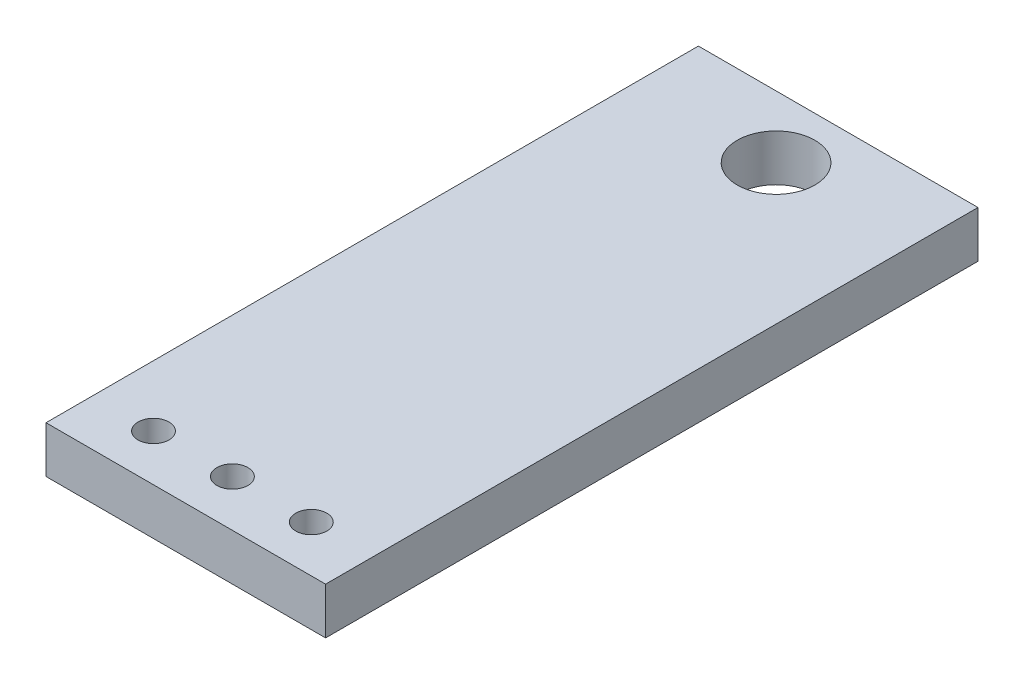
ISO-10303-21;
HEADER;
FILE_DESCRIPTION(('STEP AP214'),'2;1');
FILE_NAME('part.step','',(''),(''),'','','');
FILE_SCHEMA(('AUTOMOTIVE_DESIGN { 1 0 10303 214 1 1 1 1 }'));
ENDSEC;
DATA;
#1=APPLICATION_CONTEXT('core data for automotive mechanical design processes');
#2=APPLICATION_PROTOCOL_DEFINITION('international standard','automotive_design',2000,#1);
#3=PRODUCT_CONTEXT('',#1,'mechanical');
#4=PRODUCT('Part','Part','',(#3));
#5=PRODUCT_RELATED_PRODUCT_CATEGORY('part','',(#4));
#6=PRODUCT_DEFINITION_FORMATION('','',#4);
#7=PRODUCT_DEFINITION_CONTEXT('part definition',#1,'design');
#8=PRODUCT_DEFINITION('design','',#6,#7);
#9=PRODUCT_DEFINITION_SHAPE('','',#8);
#10=(LENGTH_UNIT() NAMED_UNIT(*) SI_UNIT(.MILLI.,.METRE.));
#11=(NAMED_UNIT(*) PLANE_ANGLE_UNIT() SI_UNIT($,.RADIAN.));
#12=(NAMED_UNIT(*) SI_UNIT($,.STERADIAN.) SOLID_ANGLE_UNIT());
#13=UNCERTAINTY_MEASURE_WITH_UNIT(LENGTH_MEASURE(1.E-05),#10,'distance_accuracy_value','');
#14=(GEOMETRIC_REPRESENTATION_CONTEXT(3) GLOBAL_UNCERTAINTY_ASSIGNED_CONTEXT((#13)) GLOBAL_UNIT_ASSIGNED_CONTEXT((#10,
#11,#12)) REPRESENTATION_CONTEXT('',''));
#15=CARTESIAN_POINT('',(0.,0.,0.));
#16=DIRECTION('',(0.,0.,1.));
#17=DIRECTION('',(1.,0.,0.));
#18=AXIS2_PLACEMENT_3D('',#15,#16,#17);
#19=CARTESIAN_POINT('',(0.,1.5,0.));
#20=DIRECTION('',(0.,-1.,0.));
#21=DIRECTION('',(0.,0.,-1.));
#22=AXIS2_PLACEMENT_3D('',#19,#20,#21);
#23=PLANE('',#22);
#24=DIRECTION('',(0.,0.,-1.));
#25=VECTOR('',#24,1.);
#26=CARTESIAN_POINT('',(4.5,1.5,10.5));
#27=LINE('',#26,#25);
#28=CARTESIAN_POINT('',(4.5,1.5,10.5));
#29=VERTEX_POINT('',#28);
#30=CARTESIAN_POINT('',(4.5,1.5,-10.5));
#31=VERTEX_POINT('',#30);
#32=EDGE_CURVE('E85',#29,#31,#27,.T.);
#33=ORIENTED_EDGE('',*,*,#32,.T.);
#34=DIRECTION('',(-1.,0.,0.));
#35=VECTOR('',#34,1.);
#36=CARTESIAN_POINT('',(-4.5,1.5,-10.5));
#37=LINE('',#36,#35);
#38=CARTESIAN_POINT('',(-4.5,1.5,-10.5));
#39=VERTEX_POINT('',#38);
#40=EDGE_CURVE('E80',#31,#39,#37,.T.);
#41=ORIENTED_EDGE('',*,*,#40,.T.);
#42=DIRECTION('',(0.,0.,1.));
#43=VECTOR('',#42,1.);
#44=CARTESIAN_POINT('',(-4.5,1.5,10.5));
#45=LINE('',#44,#43);
#46=CARTESIAN_POINT('',(-4.5,1.5,10.5));
#47=VERTEX_POINT('',#46);
#48=EDGE_CURVE('E83',#39,#47,#45,.T.);
#49=ORIENTED_EDGE('',*,*,#48,.T.);
#50=DIRECTION('',(1.,0.,0.));
#51=VECTOR('',#50,1.);
#52=CARTESIAN_POINT('',(-4.5,1.5,10.5));
#53=LINE('',#52,#51);
#54=EDGE_CURVE('E50',#47,#29,#53,.T.);
#55=ORIENTED_EDGE('',*,*,#54,.T.);
#56=EDGE_LOOP('',(#33,#41,#49,#55));
#57=FACE_BOUND('',#56,.T.);
#58=CARTESIAN_POINT('',(0.,1.5,-8.5));
#59=DIRECTION('',(0.,1.,0.));
#60=DIRECTION('',(0.,0.,1.));
#61=AXIS2_PLACEMENT_3D('',#58,#59,#60);
#62=CIRCLE('',#61,1.25);
#63=CARTESIAN_POINT('',(0.,1.5,-7.25));
#64=VERTEX_POINT('',#63);
#65=EDGE_CURVE('E100',#64,#64,#62,.T.);
#66=ORIENTED_EDGE('',*,*,#65,.F.);
#67=EDGE_LOOP('',(#66));
#68=FACE_BOUND('',#67,.T.);
#69=CARTESIAN_POINT('',(-2.54,1.5,9.));
#70=DIRECTION('',(0.,1.,0.));
#71=DIRECTION('',(0.,0.,1.));
#72=AXIS2_PLACEMENT_3D('',#69,#70,#71);
#73=CIRCLE('',#72,0.5);
#74=CARTESIAN_POINT('',(-2.54,1.5,9.5));
#75=VERTEX_POINT('',#74);
#76=EDGE_CURVE('E115',#75,#75,#73,.T.);
#77=ORIENTED_EDGE('',*,*,#76,.F.);
#78=EDGE_LOOP('',(#77));
#79=FACE_BOUND('',#78,.T.);
#80=CARTESIAN_POINT('',(0.,1.5,9.));
#81=DIRECTION('',(0.,1.,0.));
#82=DIRECTION('',(0.,0.,1.));
#83=AXIS2_PLACEMENT_3D('',#80,#81,#82);
#84=CIRCLE('',#83,0.5);
#85=CARTESIAN_POINT('',(0.,1.5,9.5));
#86=VERTEX_POINT('',#85);
#87=EDGE_CURVE('E121',#86,#86,#84,.T.);
#88=ORIENTED_EDGE('',*,*,#87,.F.);
#89=EDGE_LOOP('',(#88));
#90=FACE_BOUND('',#89,.T.);
#91=CARTESIAN_POINT('',(2.54,1.5,9.));
#92=DIRECTION('',(0.,1.,0.));
#93=DIRECTION('',(0.,0.,1.));
#94=AXIS2_PLACEMENT_3D('',#91,#92,#93);
#95=CIRCLE('',#94,0.5);
#96=CARTESIAN_POINT('',(2.54,1.5,9.5));
#97=VERTEX_POINT('',#96);
#98=EDGE_CURVE('E127',#97,#97,#95,.T.);
#99=ORIENTED_EDGE('',*,*,#98,.F.);
#100=EDGE_LOOP('',(#99));
#101=FACE_BOUND('',#100,.T.);
#102=ADVANCED_FACE('F33',(#57,#68,#79,#90,#101),#23,.F.);
#103=CARTESIAN_POINT('',(0.,0.,0.));
#104=DIRECTION('',(0.,-1.,0.));
#105=DIRECTION('',(0.,0.,-1.));
#106=AXIS2_PLACEMENT_3D('',#103,#104,#105);
#107=PLANE('',#106);
#108=CARTESIAN_POINT('',(0.,0.,9.));
#109=DIRECTION('',(0.,1.,0.));
#110=DIRECTION('',(0.,0.,1.));
#111=AXIS2_PLACEMENT_3D('',#108,#109,#110);
#112=CIRCLE('',#111,0.5);
#113=CARTESIAN_POINT('',(0.,0.,9.5));
#114=VERTEX_POINT('',#113);
#115=EDGE_CURVE('E124',#114,#114,#112,.T.);
#116=ORIENTED_EDGE('',*,*,#115,.T.);
#117=EDGE_LOOP('',(#116));
#118=FACE_BOUND('',#117,.T.);
#119=CARTESIAN_POINT('',(0.,0.,-8.5));
#120=DIRECTION('',(0.,1.,0.));
#121=DIRECTION('',(0.,0.,1.));
#122=AXIS2_PLACEMENT_3D('',#119,#120,#121);
#123=CIRCLE('',#122,1.25);
#124=CARTESIAN_POINT('',(0.,0.,-7.25));
#125=VERTEX_POINT('',#124);
#126=EDGE_CURVE('E112',#125,#125,#123,.T.);
#127=ORIENTED_EDGE('',*,*,#126,.T.);
#128=EDGE_LOOP('',(#127));
#129=FACE_BOUND('',#128,.T.);
#130=DIRECTION('',(0.,0.,-1.));
#131=VECTOR('',#130,1.);
#132=CARTESIAN_POINT('',(4.5,0.,10.5));
#133=LINE('',#132,#131);
#134=CARTESIAN_POINT('',(4.5,0.,10.5));
#135=VERTEX_POINT('',#134);
#136=CARTESIAN_POINT('',(4.5,0.,-10.5));
#137=VERTEX_POINT('',#136);
#138=EDGE_CURVE('E97',#135,#137,#133,.T.);
#139=ORIENTED_EDGE('',*,*,#138,.F.);
#140=DIRECTION('',(1.,0.,0.));
#141=VECTOR('',#140,1.);
#142=CARTESIAN_POINT('',(-4.5,0.,10.5));
#143=LINE('',#142,#141);
#144=CARTESIAN_POINT('',(-4.5,0.,10.5));
#145=VERTEX_POINT('',#144);
#146=EDGE_CURVE('E73',#145,#135,#143,.T.);
#147=ORIENTED_EDGE('',*,*,#146,.F.);
#148=DIRECTION('',(0.,0.,1.));
#149=VECTOR('',#148,1.);
#150=CARTESIAN_POINT('',(-4.5,0.,10.5));
#151=LINE('',#150,#149);
#152=CARTESIAN_POINT('',(-4.5,0.,-10.5));
#153=VERTEX_POINT('',#152);
#154=EDGE_CURVE('E67',#153,#145,#151,.T.);
#155=ORIENTED_EDGE('',*,*,#154,.F.);
#156=DIRECTION('',(-1.,0.,0.));
#157=VECTOR('',#156,1.);
#158=CARTESIAN_POINT('',(-4.5,0.,-10.5));
#159=LINE('',#158,#157);
#160=EDGE_CURVE('E89',#137,#153,#159,.T.);
#161=ORIENTED_EDGE('',*,*,#160,.F.);
#162=EDGE_LOOP('',(#139,#147,#155,#161));
#163=FACE_BOUND('',#162,.T.);
#164=CARTESIAN_POINT('',(-2.54,0.,9.));
#165=DIRECTION('',(0.,1.,0.));
#166=DIRECTION('',(0.,0.,1.));
#167=AXIS2_PLACEMENT_3D('',#164,#165,#166);
#168=CIRCLE('',#167,0.5);
#169=CARTESIAN_POINT('',(-2.54,0.,9.5));
#170=VERTEX_POINT('',#169);
#171=EDGE_CURVE('E118',#170,#170,#168,.T.);
#172=ORIENTED_EDGE('',*,*,#171,.T.);
#173=EDGE_LOOP('',(#172));
#174=FACE_BOUND('',#173,.T.);
#175=CARTESIAN_POINT('',(2.54,0.,9.));
#176=DIRECTION('',(0.,1.,0.));
#177=DIRECTION('',(0.,0.,1.));
#178=AXIS2_PLACEMENT_3D('',#175,#176,#177);
#179=CIRCLE('',#178,0.5);
#180=CARTESIAN_POINT('',(2.54,0.,9.5));
#181=VERTEX_POINT('',#180);
#182=EDGE_CURVE('E130',#181,#181,#179,.T.);
#183=ORIENTED_EDGE('',*,*,#182,.T.);
#184=EDGE_LOOP('',(#183));
#185=FACE_BOUND('',#184,.T.);
#186=ADVANCED_FACE('F108',(#118,#129,#163,#174,#185),#107,.T.);
#187=CARTESIAN_POINT('',(4.5,1.5,10.5));
#188=DIRECTION('',(-1.,0.,0.));
#189=DIRECTION('',(0.,0.,1.));
#190=AXIS2_PLACEMENT_3D('',#187,#188,#189);
#191=PLANE('',#190);
#192=ORIENTED_EDGE('',*,*,#138,.T.);
#193=DIRECTION('',(0.,-1.,0.));
#194=VECTOR('',#193,1.);
#195=CARTESIAN_POINT('',(4.5,1.5,-10.5));
#196=LINE('',#195,#194);
#197=EDGE_CURVE('E11',#31,#137,#196,.T.);
#198=ORIENTED_EDGE('',*,*,#197,.F.);
#199=ORIENTED_EDGE('',*,*,#32,.F.);
#200=DIRECTION('',(0.,-1.,0.));
#201=VECTOR('',#200,1.);
#202=CARTESIAN_POINT('',(4.5,1.5,10.5));
#203=LINE('',#202,#201);
#204=EDGE_CURVE('E93',#29,#135,#203,.T.);
#205=ORIENTED_EDGE('',*,*,#204,.T.);
#206=EDGE_LOOP('',(#192,#198,#199,#205));
#207=FACE_BOUND('',#206,.T.);
#208=ADVANCED_FACE('F35',(#207),#191,.F.);
#209=CARTESIAN_POINT('',(-4.5,1.5,-10.5));
#210=DIRECTION('',(0.,0.,1.));
#211=DIRECTION('',(1.,0.,0.));
#212=AXIS2_PLACEMENT_3D('',#209,#210,#211);
#213=PLANE('',#212);
#214=ORIENTED_EDGE('',*,*,#160,.T.);
#215=DIRECTION('',(0.,-1.,0.));
#216=VECTOR('',#215,1.);
#217=CARTESIAN_POINT('',(-4.5,1.5,-10.5));
#218=LINE('',#217,#216);
#219=EDGE_CURVE('E42',#39,#153,#218,.T.);
#220=ORIENTED_EDGE('',*,*,#219,.F.);
#221=ORIENTED_EDGE('',*,*,#40,.F.);
#222=ORIENTED_EDGE('',*,*,#197,.T.);
#223=EDGE_LOOP('',(#214,#220,#221,#222));
#224=FACE_BOUND('',#223,.T.);
#225=ADVANCED_FACE('F88',(#224),#213,.F.);
#226=CARTESIAN_POINT('',(-4.5,1.5,10.5));
#227=DIRECTION('',(1.,0.,0.));
#228=DIRECTION('',(0.,0.,-1.));
#229=AXIS2_PLACEMENT_3D('',#226,#227,#228);
#230=PLANE('',#229);
#231=ORIENTED_EDGE('',*,*,#154,.T.);
#232=DIRECTION('',(0.,-1.,0.));
#233=VECTOR('',#232,1.);
#234=CARTESIAN_POINT('',(-4.5,1.5,10.5));
#235=LINE('',#234,#233);
#236=EDGE_CURVE('E90',#47,#145,#235,.T.);
#237=ORIENTED_EDGE('',*,*,#236,.F.);
#238=ORIENTED_EDGE('',*,*,#48,.F.);
#239=ORIENTED_EDGE('',*,*,#219,.T.);
#240=EDGE_LOOP('',(#231,#237,#238,#239));
#241=FACE_BOUND('',#240,.T.);
#242=ADVANCED_FACE('F91',(#241),#230,.F.);
#243=CARTESIAN_POINT('',(-4.5,1.5,10.5));
#244=DIRECTION('',(0.,0.,-1.));
#245=DIRECTION('',(-1.,0.,0.));
#246=AXIS2_PLACEMENT_3D('',#243,#244,#245);
#247=PLANE('',#246);
#248=ORIENTED_EDGE('',*,*,#146,.T.);
#249=ORIENTED_EDGE('',*,*,#204,.F.);
#250=ORIENTED_EDGE('',*,*,#54,.F.);
#251=ORIENTED_EDGE('',*,*,#236,.T.);
#252=EDGE_LOOP('',(#248,#249,#250,#251));
#253=FACE_BOUND('',#252,.T.);
#254=ADVANCED_FACE('F105',(#253),#247,.F.);
#255=CARTESIAN_POINT('',(0.,1.5,-8.5));
#256=DIRECTION('',(0.,-1.,0.));
#257=DIRECTION('',(0.,0.,-1.));
#258=AXIS2_PLACEMENT_3D('',#255,#256,#257);
#259=CYLINDRICAL_SURFACE('',#258,1.25);
#260=ORIENTED_EDGE('',*,*,#65,.T.);
#261=EDGE_LOOP('',(#260));
#262=FACE_BOUND('',#261,.T.);
#263=ORIENTED_EDGE('',*,*,#126,.F.);
#264=EDGE_LOOP('',(#263));
#265=FACE_BOUND('',#264,.T.);
#266=ADVANCED_FACE('F147',(#262,#265),#259,.F.);
#267=CARTESIAN_POINT('',(-2.54,1.5,9.));
#268=DIRECTION('',(0.,-1.,0.));
#269=DIRECTION('',(0.,0.,-1.));
#270=AXIS2_PLACEMENT_3D('',#267,#268,#269);
#271=CYLINDRICAL_SURFACE('',#270,0.5);
#272=ORIENTED_EDGE('',*,*,#76,.T.);
#273=EDGE_LOOP('',(#272));
#274=FACE_BOUND('',#273,.T.);
#275=ORIENTED_EDGE('',*,*,#171,.F.);
#276=EDGE_LOOP('',(#275));
#277=FACE_BOUND('',#276,.T.);
#278=ADVANCED_FACE('F193',(#274,#277),#271,.F.);
#279=CARTESIAN_POINT('',(0.,1.5,9.));
#280=DIRECTION('',(0.,-1.,0.));
#281=DIRECTION('',(0.,0.,-1.));
#282=AXIS2_PLACEMENT_3D('',#279,#280,#281);
#283=CYLINDRICAL_SURFACE('',#282,0.5);
#284=ORIENTED_EDGE('',*,*,#87,.T.);
#285=EDGE_LOOP('',(#284));
#286=FACE_BOUND('',#285,.T.);
#287=ORIENTED_EDGE('',*,*,#115,.F.);
#288=EDGE_LOOP('',(#287));
#289=FACE_BOUND('',#288,.T.);
#290=ADVANCED_FACE('F201',(#286,#289),#283,.F.);
#291=CARTESIAN_POINT('',(2.54,1.5,9.));
#292=DIRECTION('',(0.,-1.,0.));
#293=DIRECTION('',(0.,0.,-1.));
#294=AXIS2_PLACEMENT_3D('',#291,#292,#293);
#295=CYLINDRICAL_SURFACE('',#294,0.5);
#296=ORIENTED_EDGE('',*,*,#98,.T.);
#297=EDGE_LOOP('',(#296));
#298=FACE_BOUND('',#297,.T.);
#299=ORIENTED_EDGE('',*,*,#182,.F.);
#300=EDGE_LOOP('',(#299));
#301=FACE_BOUND('',#300,.T.);
#302=ADVANCED_FACE('F136',(#298,#301),#295,.F.);
#303=CLOSED_SHELL('',(#102,#186,#208,#225,#242,#254,#266,#278,#290,#302));
#304=MANIFOLD_SOLID_BREP('B2',#303);
#305=ADVANCED_BREP_SHAPE_REPRESENTATION('',(#18,#304),#14);
#306=SHAPE_DEFINITION_REPRESENTATION(#9,#305);
ENDSEC;
END-ISO-10303-21;
